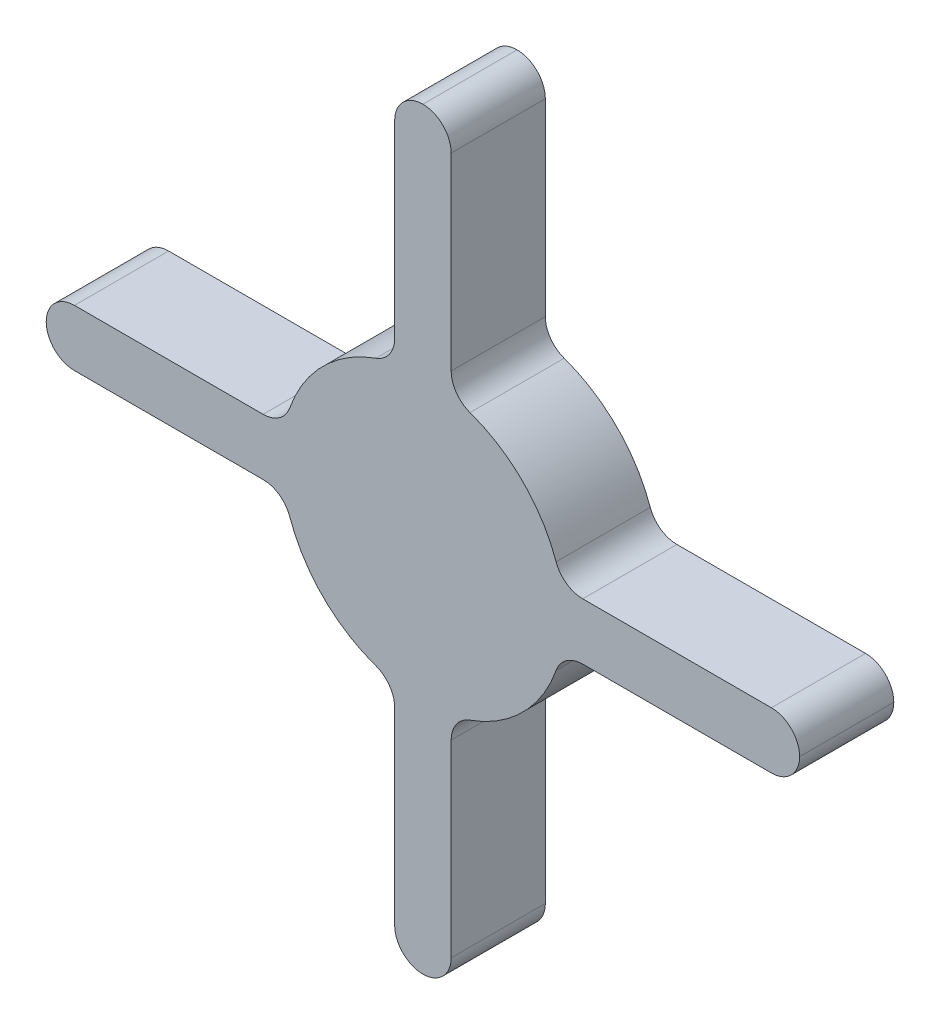
ISO-10303-21;
HEADER;
FILE_DESCRIPTION(('STEP AP214'),'2;1');
FILE_NAME('part.step','',(''),(''),'','','');
FILE_SCHEMA(('AUTOMOTIVE_DESIGN { 1 0 10303 214 1 1 1 1 }'));
ENDSEC;
DATA;
#1=APPLICATION_CONTEXT('core data for automotive mechanical design processes');
#2=APPLICATION_PROTOCOL_DEFINITION('international standard','automotive_design',2000,#1);
#3=PRODUCT_CONTEXT('',#1,'mechanical');
#4=PRODUCT('Part','Part','',(#3));
#5=PRODUCT_RELATED_PRODUCT_CATEGORY('part','',(#4));
#6=PRODUCT_DEFINITION_FORMATION('','',#4);
#7=PRODUCT_DEFINITION_CONTEXT('part definition',#1,'design');
#8=PRODUCT_DEFINITION('design','',#6,#7);
#9=PRODUCT_DEFINITION_SHAPE('','',#8);
#10=(LENGTH_UNIT() NAMED_UNIT(*) SI_UNIT(.MILLI.,.METRE.));
#11=(NAMED_UNIT(*) PLANE_ANGLE_UNIT() SI_UNIT($,.RADIAN.));
#12=(NAMED_UNIT(*) SI_UNIT($,.STERADIAN.) SOLID_ANGLE_UNIT());
#13=UNCERTAINTY_MEASURE_WITH_UNIT(LENGTH_MEASURE(1.E-05),#10,'distance_accuracy_value','');
#14=(GEOMETRIC_REPRESENTATION_CONTEXT(3) GLOBAL_UNCERTAINTY_ASSIGNED_CONTEXT((#13)) GLOBAL_UNIT_ASSIGNED_CONTEXT((#10,
#11,#12)) REPRESENTATION_CONTEXT('',''));
#15=CARTESIAN_POINT('',(0.,0.,0.));
#16=DIRECTION('',(0.,0.,1.));
#17=DIRECTION('',(1.,0.,0.));
#18=AXIS2_PLACEMENT_3D('',#15,#16,#17);
#19=CARTESIAN_POINT('',(-1.90499999999999,1.905,6.35));
#20=DIRECTION('',(1.,0.,0.));
#21=DIRECTION('',(0.,1.,0.));
#22=AXIS2_PLACEMENT_3D('',#19,#20,#21);
#23=PLANE('',#22);
#24=DIRECTION('',(0.,-1.,0.));
#25=VECTOR('',#24,1.);
#26=CARTESIAN_POINT('',(-1.90499999999999,1.905,0.));
#27=LINE('',#26,#25);
#28=CARTESIAN_POINT('',(-1.90499999999999,23.495,0.));
#29=VERTEX_POINT('',#28);
#30=CARTESIAN_POINT('',(-1.90499999999999,10.776307345283,0.));
#31=VERTEX_POINT('',#30);
#32=EDGE_CURVE('E412',#29,#31,#27,.T.);
#33=ORIENTED_EDGE('',*,*,#32,.T.);
#34=DIRECTION('',(0.,0.,1.));
#35=VECTOR('',#34,1.);
#36=CARTESIAN_POINT('',(-1.90499999999999,10.776307345283,6.35));
#37=LINE('',#36,#35);
#38=CARTESIAN_POINT('',(-1.90499999999999,10.776307345283,6.35));
#39=VERTEX_POINT('',#38);
#40=EDGE_CURVE('E272',#31,#39,#37,.T.);
#41=ORIENTED_EDGE('',*,*,#40,.T.);
#42=DIRECTION('',(0.,-1.,0.));
#43=VECTOR('',#42,1.);
#44=CARTESIAN_POINT('',(-1.90499999999999,1.905,6.35));
#45=LINE('',#44,#43);
#46=CARTESIAN_POINT('',(-1.90499999999999,23.495,6.35));
#47=VERTEX_POINT('',#46);
#48=EDGE_CURVE('E389',#47,#39,#45,.T.);
#49=ORIENTED_EDGE('',*,*,#48,.F.);
#50=DIRECTION('',(0.,0.,-1.));
#51=VECTOR('',#50,1.);
#52=CARTESIAN_POINT('',(-1.90499999999999,23.495,6.35));
#53=LINE('',#52,#51);
#54=EDGE_CURVE('E269',#47,#29,#53,.T.);
#55=ORIENTED_EDGE('',*,*,#54,.T.);
#56=EDGE_LOOP('',(#33,#41,#49,#55));
#57=FACE_BOUND('',#56,.T.);
#58=ADVANCED_FACE('F33',(#57),#23,.F.);
#59=CARTESIAN_POINT('',(-25.4,1.905,6.35));
#60=DIRECTION('',(0.,-1.,0.));
#61=DIRECTION('',(1.,0.,0.));
#62=AXIS2_PLACEMENT_3D('',#59,#60,#61);
#63=PLANE('',#62);
#64=DIRECTION('',(-1.,0.,0.));
#65=VECTOR('',#64,1.);
#66=CARTESIAN_POINT('',(-25.4,1.905,6.35));
#67=LINE('',#66,#65);
#68=CARTESIAN_POINT('',(-10.776307345283,1.905,6.35));
#69=VERTEX_POINT('',#68);
#70=CARTESIAN_POINT('',(-23.495,1.905,6.35));
#71=VERTEX_POINT('',#70);
#72=EDGE_CURVE('E392',#69,#71,#67,.T.);
#73=ORIENTED_EDGE('',*,*,#72,.F.);
#74=DIRECTION('',(0.,0.,1.));
#75=VECTOR('',#74,1.);
#76=CARTESIAN_POINT('',(-10.776307345283,1.905,0.));
#77=LINE('',#76,#75);
#78=CARTESIAN_POINT('',(-10.776307345283,1.905,0.));
#79=VERTEX_POINT('',#78);
#80=EDGE_CURVE('E267',#69,#79,#77,.F.);
#81=ORIENTED_EDGE('',*,*,#80,.T.);
#82=DIRECTION('',(-1.,0.,0.));
#83=VECTOR('',#82,1.);
#84=CARTESIAN_POINT('',(-25.4,1.905,0.));
#85=LINE('',#84,#83);
#86=CARTESIAN_POINT('',(-23.495,1.905,0.));
#87=VERTEX_POINT('',#86);
#88=EDGE_CURVE('E409',#79,#87,#85,.T.);
#89=ORIENTED_EDGE('',*,*,#88,.T.);
#90=DIRECTION('',(0.,0.,-1.));
#91=VECTOR('',#90,1.);
#92=CARTESIAN_POINT('',(-23.495,1.905,6.35));
#93=LINE('',#92,#91);
#94=EDGE_CURVE('E265',#87,#71,#93,.F.);
#95=ORIENTED_EDGE('',*,*,#94,.T.);
#96=EDGE_LOOP('',(#73,#81,#89,#95));
#97=FACE_BOUND('',#96,.T.);
#98=ADVANCED_FACE('F456',(#97),#63,.F.);
#99=CARTESIAN_POINT('',(-1.90499999999999,-1.905,6.35));
#100=DIRECTION('',(0.,1.,0.));
#101=DIRECTION('',(-1.,0.,0.));
#102=AXIS2_PLACEMENT_3D('',#99,#100,#101);
#103=PLANE('',#102);
#104=DIRECTION('',(1.,0.,0.));
#105=VECTOR('',#104,1.);
#106=CARTESIAN_POINT('',(-1.90499999999999,-1.905,0.));
#107=LINE('',#106,#105);
#108=CARTESIAN_POINT('',(-23.495,-1.905,0.));
#109=VERTEX_POINT('',#108);
#110=CARTESIAN_POINT('',(-10.776307345283,-1.905,0.));
#111=VERTEX_POINT('',#110);
#112=EDGE_CURVE('E406',#109,#111,#107,.T.);
#113=ORIENTED_EDGE('',*,*,#112,.T.);
#114=DIRECTION('',(0.,0.,1.));
#115=VECTOR('',#114,1.);
#116=CARTESIAN_POINT('',(-10.776307345283,-1.905,6.35));
#117=LINE('',#116,#115);
#118=CARTESIAN_POINT('',(-10.776307345283,-1.905,6.35));
#119=VERTEX_POINT('',#118);
#120=EDGE_CURVE('E248',#111,#119,#117,.T.);
#121=ORIENTED_EDGE('',*,*,#120,.T.);
#122=DIRECTION('',(1.,0.,0.));
#123=VECTOR('',#122,1.);
#124=CARTESIAN_POINT('',(-1.90499999999999,-1.905,6.35));
#125=LINE('',#124,#123);
#126=CARTESIAN_POINT('',(-23.495,-1.905,6.35));
#127=VERTEX_POINT('',#126);
#128=EDGE_CURVE('E225',#127,#119,#125,.T.);
#129=ORIENTED_EDGE('',*,*,#128,.F.);
#130=DIRECTION('',(0.,0.,-1.));
#131=VECTOR('',#130,1.);
#132=CARTESIAN_POINT('',(-23.495,-1.905,6.35));
#133=LINE('',#132,#131);
#134=EDGE_CURVE('E245',#127,#109,#133,.T.);
#135=ORIENTED_EDGE('',*,*,#134,.T.);
#136=EDGE_LOOP('',(#113,#121,#129,#135));
#137=FACE_BOUND('',#136,.T.);
#138=ADVANCED_FACE('F461',(#137),#103,.F.);
#139=CARTESIAN_POINT('',(-1.90499999999999,-25.4,6.35));
#140=DIRECTION('',(1.,0.,0.));
#141=DIRECTION('',(0.,1.,0.));
#142=AXIS2_PLACEMENT_3D('',#139,#140,#141);
#143=PLANE('',#142);
#144=DIRECTION('',(0.,-1.,0.));
#145=VECTOR('',#144,1.);
#146=CARTESIAN_POINT('',(-1.90499999999999,-25.4,6.35));
#147=LINE('',#146,#145);
#148=CARTESIAN_POINT('',(-1.90499999999999,-10.776307345283,6.35));
#149=VERTEX_POINT('',#148);
#150=CARTESIAN_POINT('',(-1.90499999999999,-23.495,6.35));
#151=VERTEX_POINT('',#150);
#152=EDGE_CURVE('E426',#149,#151,#147,.T.);
#153=ORIENTED_EDGE('',*,*,#152,.F.);
#154=DIRECTION('',(0.,0.,1.));
#155=VECTOR('',#154,1.);
#156=CARTESIAN_POINT('',(-1.90499999999999,-10.776307345283,0.));
#157=LINE('',#156,#155);
#158=CARTESIAN_POINT('',(-1.90499999999999,-10.776307345283,0.));
#159=VERTEX_POINT('',#158);
#160=EDGE_CURVE('E257',#149,#159,#157,.F.);
#161=ORIENTED_EDGE('',*,*,#160,.T.);
#162=DIRECTION('',(0.,-1.,0.));
#163=VECTOR('',#162,1.);
#164=CARTESIAN_POINT('',(-1.90499999999999,-25.4,0.));
#165=LINE('',#164,#163);
#166=CARTESIAN_POINT('',(-1.90499999999999,-23.495,0.));
#167=VERTEX_POINT('',#166);
#168=EDGE_CURVE('E403',#159,#167,#165,.T.);
#169=ORIENTED_EDGE('',*,*,#168,.T.);
#170=DIRECTION('',(0.,0.,-1.));
#171=VECTOR('',#170,1.);
#172=CARTESIAN_POINT('',(-1.90499999999999,-23.495,6.35));
#173=LINE('',#172,#171);
#174=EDGE_CURVE('E255',#167,#151,#173,.F.);
#175=ORIENTED_EDGE('',*,*,#174,.T.);
#176=EDGE_LOOP('',(#153,#161,#169,#175));
#177=FACE_BOUND('',#176,.T.);
#178=ADVANCED_FACE('F644',(#177),#143,.F.);
#179=CARTESIAN_POINT('',(1.905,-1.905,6.35));
#180=DIRECTION('',(-1.,0.,0.));
#181=DIRECTION('',(0.,-1.,0.));
#182=AXIS2_PLACEMENT_3D('',#179,#180,#181);
#183=PLANE('',#182);
#184=DIRECTION('',(0.,1.,0.));
#185=VECTOR('',#184,1.);
#186=CARTESIAN_POINT('',(1.905,-1.905,0.));
#187=LINE('',#186,#185);
#188=CARTESIAN_POINT('',(1.90500000000001,-23.495,0.));
#189=VERTEX_POINT('',#188);
#190=CARTESIAN_POINT('',(1.905,-10.776307345283,0.));
#191=VERTEX_POINT('',#190);
#192=EDGE_CURVE('E400',#189,#191,#187,.T.);
#193=ORIENTED_EDGE('',*,*,#192,.T.);
#194=DIRECTION('',(0.,0.,1.));
#195=VECTOR('',#194,1.);
#196=CARTESIAN_POINT('',(1.905,-10.776307345283,6.35));
#197=LINE('',#196,#195);
#198=CARTESIAN_POINT('',(1.905,-10.776307345283,6.35));
#199=VERTEX_POINT('',#198);
#200=EDGE_CURVE('E302',#191,#199,#197,.T.);
#201=ORIENTED_EDGE('',*,*,#200,.T.);
#202=DIRECTION('',(0.,1.,0.));
#203=VECTOR('',#202,1.);
#204=CARTESIAN_POINT('',(1.905,-1.905,6.35));
#205=LINE('',#204,#203);
#206=CARTESIAN_POINT('',(1.90500000000001,-23.495,6.35));
#207=VERTEX_POINT('',#206);
#208=EDGE_CURVE('E423',#207,#199,#205,.T.);
#209=ORIENTED_EDGE('',*,*,#208,.F.);
#210=DIRECTION('',(0.,0.,-1.));
#211=VECTOR('',#210,1.);
#212=CARTESIAN_POINT('',(1.90500000000001,-23.495,6.35));
#213=LINE('',#212,#211);
#214=EDGE_CURVE('E299',#207,#189,#213,.T.);
#215=ORIENTED_EDGE('',*,*,#214,.T.);
#216=EDGE_LOOP('',(#193,#201,#209,#215));
#217=FACE_BOUND('',#216,.T.);
#218=ADVANCED_FACE('F636',(#217),#183,.F.);
#219=CARTESIAN_POINT('',(25.4,-1.905,6.35));
#220=DIRECTION('',(0.,1.,0.));
#221=DIRECTION('',(-1.,0.,0.));
#222=AXIS2_PLACEMENT_3D('',#219,#220,#221);
#223=PLANE('',#222);
#224=DIRECTION('',(1.,0.,0.));
#225=VECTOR('',#224,1.);
#226=CARTESIAN_POINT('',(25.4,-1.905,6.35));
#227=LINE('',#226,#225);
#228=CARTESIAN_POINT('',(10.776307345283,-1.905,6.35));
#229=VERTEX_POINT('',#228);
#230=CARTESIAN_POINT('',(23.495,-1.905,6.35));
#231=VERTEX_POINT('',#230);
#232=EDGE_CURVE('E420',#229,#231,#227,.T.);
#233=ORIENTED_EDGE('',*,*,#232,.F.);
#234=DIRECTION('',(0.,0.,1.));
#235=VECTOR('',#234,1.);
#236=CARTESIAN_POINT('',(10.776307345283,-1.905,0.));
#237=LINE('',#236,#235);
#238=CARTESIAN_POINT('',(10.776307345283,-1.905,0.));
#239=VERTEX_POINT('',#238);
#240=EDGE_CURVE('E297',#229,#239,#237,.F.);
#241=ORIENTED_EDGE('',*,*,#240,.T.);
#242=DIRECTION('',(1.,0.,0.));
#243=VECTOR('',#242,1.);
#244=CARTESIAN_POINT('',(25.4,-1.905,0.));
#245=LINE('',#244,#243);
#246=CARTESIAN_POINT('',(23.495,-1.905,0.));
#247=VERTEX_POINT('',#246);
#248=EDGE_CURVE('E395',#239,#247,#245,.T.);
#249=ORIENTED_EDGE('',*,*,#248,.T.);
#250=DIRECTION('',(0.,0.,-1.));
#251=VECTOR('',#250,1.);
#252=CARTESIAN_POINT('',(23.495,-1.905,6.35));
#253=LINE('',#252,#251);
#254=EDGE_CURVE('E295',#247,#231,#253,.F.);
#255=ORIENTED_EDGE('',*,*,#254,.T.);
#256=EDGE_LOOP('',(#233,#241,#249,#255));
#257=FACE_BOUND('',#256,.T.);
#258=ADVANCED_FACE('F628',(#257),#223,.F.);
#259=CARTESIAN_POINT('',(1.90500000000001,1.905,6.35));
#260=DIRECTION('',(0.,-1.,0.));
#261=DIRECTION('',(1.,0.,0.));
#262=AXIS2_PLACEMENT_3D('',#259,#260,#261);
#263=PLANE('',#262);
#264=DIRECTION('',(-1.,0.,0.));
#265=VECTOR('',#264,1.);
#266=CARTESIAN_POINT('',(1.90500000000001,1.905,0.));
#267=LINE('',#266,#265);
#268=CARTESIAN_POINT('',(23.495,1.905,0.));
#269=VERTEX_POINT('',#268);
#270=CARTESIAN_POINT('',(10.776307345283,1.905,0.));
#271=VERTEX_POINT('',#270);
#272=EDGE_CURVE('E390',#269,#271,#267,.T.);
#273=ORIENTED_EDGE('',*,*,#272,.T.);
#274=DIRECTION('',(0.,0.,1.));
#275=VECTOR('',#274,1.);
#276=CARTESIAN_POINT('',(10.776307345283,1.905,6.35));
#277=LINE('',#276,#275);
#278=CARTESIAN_POINT('',(10.776307345283,1.905,6.35));
#279=VERTEX_POINT('',#278);
#280=EDGE_CURVE('E287',#271,#279,#277,.T.);
#281=ORIENTED_EDGE('',*,*,#280,.T.);
#282=DIRECTION('',(-1.,0.,0.));
#283=VECTOR('',#282,1.);
#284=CARTESIAN_POINT('',(1.90500000000001,1.905,6.35));
#285=LINE('',#284,#283);
#286=CARTESIAN_POINT('',(23.495,1.905,6.35));
#287=VERTEX_POINT('',#286);
#288=EDGE_CURVE('E417',#287,#279,#285,.T.);
#289=ORIENTED_EDGE('',*,*,#288,.F.);
#290=DIRECTION('',(0.,0.,-1.));
#291=VECTOR('',#290,1.);
#292=CARTESIAN_POINT('',(23.495,1.905,6.35));
#293=LINE('',#292,#291);
#294=EDGE_CURVE('E284',#287,#269,#293,.T.);
#295=ORIENTED_EDGE('',*,*,#294,.T.);
#296=EDGE_LOOP('',(#273,#281,#289,#295));
#297=FACE_BOUND('',#296,.T.);
#298=ADVANCED_FACE('F621',(#297),#263,.F.);
#299=CARTESIAN_POINT('',(1.90500000000001,25.4,6.35));
#300=DIRECTION('',(-1.,0.,0.));
#301=DIRECTION('',(0.,-1.,0.));
#302=AXIS2_PLACEMENT_3D('',#299,#300,#301);
#303=PLANE('',#302);
#304=DIRECTION('',(0.,1.,0.));
#305=VECTOR('',#304,1.);
#306=CARTESIAN_POINT('',(1.90500000000001,25.4,6.35));
#307=LINE('',#306,#305);
#308=CARTESIAN_POINT('',(1.90500000000001,10.776307345283,6.35));
#309=VERTEX_POINT('',#308);
#310=CARTESIAN_POINT('',(1.90500000000001,23.495,6.35));
#311=VERTEX_POINT('',#310);
#312=EDGE_CURVE('E250',#309,#311,#307,.T.);
#313=ORIENTED_EDGE('',*,*,#312,.F.);
#314=DIRECTION('',(0.,0.,1.));
#315=VECTOR('',#314,1.);
#316=CARTESIAN_POINT('',(1.90500000000001,10.776307345283,0.));
#317=LINE('',#316,#315);
#318=CARTESIAN_POINT('',(1.90500000000001,10.776307345283,0.));
#319=VERTEX_POINT('',#318);
#320=EDGE_CURVE('E282',#309,#319,#317,.F.);
#321=ORIENTED_EDGE('',*,*,#320,.T.);
#322=DIRECTION('',(0.,1.,0.));
#323=VECTOR('',#322,1.);
#324=CARTESIAN_POINT('',(1.90500000000001,25.4,0.));
#325=LINE('',#324,#323);
#326=CARTESIAN_POINT('',(1.90500000000001,23.495,0.));
#327=VERTEX_POINT('',#326);
#328=EDGE_CURVE('E382',#319,#327,#325,.T.);
#329=ORIENTED_EDGE('',*,*,#328,.T.);
#330=DIRECTION('',(0.,0.,-1.));
#331=VECTOR('',#330,1.);
#332=CARTESIAN_POINT('',(1.90500000000001,23.495,6.35));
#333=LINE('',#332,#331);
#334=EDGE_CURVE('E280',#327,#311,#333,.F.);
#335=ORIENTED_EDGE('',*,*,#334,.T.);
#336=EDGE_LOOP('',(#313,#321,#329,#335));
#337=FACE_BOUND('',#336,.T.);
#338=ADVANCED_FACE('F387',(#337),#303,.F.);
#339=CARTESIAN_POINT('',(1.90500000000001,25.4,6.35));
#340=DIRECTION('',(0.,0.,-1.));
#341=DIRECTION('',(-1.,0.,0.));
#342=AXIS2_PLACEMENT_3D('',#339,#340,#341);
#343=PLANE('',#342);
#344=CARTESIAN_POINT('',(23.495,0.,6.35));
#345=DIRECTION('',(0.,0.,-1.));
#346=DIRECTION('',(-1.,0.,0.));
#347=AXIS2_PLACEMENT_3D('',#344,#345,#346);
#348=CIRCLE('',#347,1.905);
#349=CARTESIAN_POINT('',(25.4,0.,6.35));
#350=VERTEX_POINT('',#349);
#351=EDGE_CURVE('E330',#231,#350,#348,.F.);
#352=ORIENTED_EDGE('',*,*,#351,.T.);
#353=CARTESIAN_POINT('',(23.495,0.,6.35));
#354=DIRECTION('',(0.,0.,-1.));
#355=DIRECTION('',(-1.,0.,0.));
#356=AXIS2_PLACEMENT_3D('',#353,#354,#355);
#357=CIRCLE('',#356,1.905);
#358=EDGE_CURVE('E332',#350,#287,#357,.F.);
#359=ORIENTED_EDGE('',*,*,#358,.T.);
#360=ORIENTED_EDGE('',*,*,#288,.T.);
#361=CARTESIAN_POINT('',(10.776307345283,3.81,6.35));
#362=DIRECTION('',(0.,0.,-1.));
#363=DIRECTION('',(-1.,0.,0.));
#364=AXIS2_PLACEMENT_3D('',#361,#362,#363);
#365=CIRCLE('',#364,1.905);
#366=CARTESIAN_POINT('',(8.98025612106916,3.175,6.35));
#367=VERTEX_POINT('',#366);
#368=EDGE_CURVE('E352',#279,#367,#365,.T.);
#369=ORIENTED_EDGE('',*,*,#368,.T.);
#370=CARTESIAN_POINT('',(0.,0.,6.35));
#371=DIRECTION('',(0.,0.,1.));
#372=DIRECTION('',(1.,0.,0.));
#373=AXIS2_PLACEMENT_3D('',#370,#371,#372);
#374=CIRCLE('',#373,9.525);
#375=CARTESIAN_POINT('',(3.17500000000001,8.98025612106915,6.35));
#376=VERTEX_POINT('',#375);
#377=EDGE_CURVE('E415',#367,#376,#374,.T.);
#378=ORIENTED_EDGE('',*,*,#377,.T.);
#379=CARTESIAN_POINT('',(3.81000000000001,10.776307345283,6.35));
#380=DIRECTION('',(0.,0.,-1.));
#381=DIRECTION('',(-1.,0.,0.));
#382=AXIS2_PLACEMENT_3D('',#379,#380,#381);
#383=CIRCLE('',#382,1.905);
#384=EDGE_CURVE('E346',#376,#309,#383,.T.);
#385=ORIENTED_EDGE('',*,*,#384,.T.);
#386=ORIENTED_EDGE('',*,*,#312,.T.);
#387=CARTESIAN_POINT('',(0.,23.495,6.35));
#388=DIRECTION('',(0.,0.,-1.));
#389=DIRECTION('',(-1.,0.,0.));
#390=AXIS2_PLACEMENT_3D('',#387,#388,#389);
#391=CIRCLE('',#390,1.905);
#392=CARTESIAN_POINT('',(0.,25.4,6.35));
#393=VERTEX_POINT('',#392);
#394=EDGE_CURVE('E57',#311,#393,#391,.F.);
#395=ORIENTED_EDGE('',*,*,#394,.T.);
#396=CARTESIAN_POINT('',(0.,23.495,6.35));
#397=DIRECTION('',(0.,0.,-1.));
#398=DIRECTION('',(-1.,0.,0.));
#399=AXIS2_PLACEMENT_3D('',#396,#397,#398);
#400=CIRCLE('',#399,1.905);
#401=EDGE_CURVE('E321',#393,#47,#400,.F.);
#402=ORIENTED_EDGE('',*,*,#401,.T.);
#403=ORIENTED_EDGE('',*,*,#48,.T.);
#404=CARTESIAN_POINT('',(-3.80999999999999,10.776307345283,6.35));
#405=DIRECTION('',(0.,0.,-1.));
#406=DIRECTION('',(-1.,0.,0.));
#407=AXIS2_PLACEMENT_3D('',#404,#405,#406);
#408=CIRCLE('',#407,1.905);
#409=CARTESIAN_POINT('',(-3.17499999999999,8.98025612106916,6.35));
#410=VERTEX_POINT('',#409);
#411=EDGE_CURVE('E344',#39,#410,#408,.T.);
#412=ORIENTED_EDGE('',*,*,#411,.T.);
#413=CARTESIAN_POINT('',(-8.98025612106916,3.175,6.35));
#414=VERTEX_POINT('',#413);
#415=EDGE_CURVE('E241',#410,#414,#374,.T.);
#416=ORIENTED_EDGE('',*,*,#415,.T.);
#417=CARTESIAN_POINT('',(-10.776307345283,3.81,6.35));
#418=DIRECTION('',(0.,0.,-1.));
#419=DIRECTION('',(-1.,0.,0.));
#420=AXIS2_PLACEMENT_3D('',#417,#418,#419);
#421=CIRCLE('',#420,1.905);
#422=EDGE_CURVE('E338',#414,#69,#421,.T.);
#423=ORIENTED_EDGE('',*,*,#422,.T.);
#424=ORIENTED_EDGE('',*,*,#72,.T.);
#425=CARTESIAN_POINT('',(-23.495,0.,6.35));
#426=DIRECTION('',(0.,0.,-1.));
#427=DIRECTION('',(-1.,0.,0.));
#428=AXIS2_PLACEMENT_3D('',#425,#426,#427);
#429=CIRCLE('',#428,1.905);
#430=CARTESIAN_POINT('',(-25.4,0.,6.35));
#431=VERTEX_POINT('',#430);
#432=EDGE_CURVE('E50',#71,#431,#429,.F.);
#433=ORIENTED_EDGE('',*,*,#432,.T.);
#434=CARTESIAN_POINT('',(-23.495,0.,6.35));
#435=DIRECTION('',(0.,0.,-1.));
#436=DIRECTION('',(-1.,0.,0.));
#437=AXIS2_PLACEMENT_3D('',#434,#435,#436);
#438=CIRCLE('',#437,1.905);
#439=EDGE_CURVE('E324',#431,#127,#438,.F.);
#440=ORIENTED_EDGE('',*,*,#439,.T.);
#441=ORIENTED_EDGE('',*,*,#128,.T.);
#442=CARTESIAN_POINT('',(-10.776307345283,-3.81,6.35));
#443=DIRECTION('',(0.,0.,-1.));
#444=DIRECTION('',(-1.,0.,0.));
#445=AXIS2_PLACEMENT_3D('',#442,#443,#444);
#446=CIRCLE('',#445,1.905);
#447=CARTESIAN_POINT('',(-8.98025612106916,-3.175,6.35));
#448=VERTEX_POINT('',#447);
#449=EDGE_CURVE('E220',#119,#448,#446,.T.);
#450=ORIENTED_EDGE('',*,*,#449,.T.);
#451=CARTESIAN_POINT('',(-3.17499999999999,-8.98025612106916,6.35));
#452=VERTEX_POINT('',#451);
#453=EDGE_CURVE('E223',#448,#452,#374,.T.);
#454=ORIENTED_EDGE('',*,*,#453,.T.);
#455=CARTESIAN_POINT('',(-3.80999999999999,-10.776307345283,6.35));
#456=DIRECTION('',(0.,0.,-1.));
#457=DIRECTION('',(-1.,0.,0.));
#458=AXIS2_PLACEMENT_3D('',#455,#456,#457);
#459=CIRCLE('',#458,1.905);
#460=EDGE_CURVE('E229',#452,#149,#459,.T.);
#461=ORIENTED_EDGE('',*,*,#460,.T.);
#462=ORIENTED_EDGE('',*,*,#152,.T.);
#463=CARTESIAN_POINT('',(0.,-23.495,6.35));
#464=DIRECTION('',(0.,0.,-1.));
#465=DIRECTION('',(-1.,0.,0.));
#466=AXIS2_PLACEMENT_3D('',#463,#464,#465);
#467=CIRCLE('',#466,1.905);
#468=CARTESIAN_POINT('',(0.,-25.4,6.35));
#469=VERTEX_POINT('',#468);
#470=EDGE_CURVE('E326',#151,#469,#467,.F.);
#471=ORIENTED_EDGE('',*,*,#470,.T.);
#472=CARTESIAN_POINT('',(0.,-23.495,6.35));
#473=DIRECTION('',(0.,0.,-1.));
#474=DIRECTION('',(-1.,0.,0.));
#475=AXIS2_PLACEMENT_3D('',#472,#473,#474);
#476=CIRCLE('',#475,1.905);
#477=EDGE_CURVE('E328',#469,#207,#476,.F.);
#478=ORIENTED_EDGE('',*,*,#477,.T.);
#479=ORIENTED_EDGE('',*,*,#208,.T.);
#480=CARTESIAN_POINT('',(3.81,-10.776307345283,6.35));
#481=DIRECTION('',(0.,0.,-1.));
#482=DIRECTION('',(-1.,0.,0.));
#483=AXIS2_PLACEMENT_3D('',#480,#481,#482);
#484=CIRCLE('',#483,1.905);
#485=CARTESIAN_POINT('',(3.175,-8.98025612106915,6.35));
#486=VERTEX_POINT('',#485);
#487=EDGE_CURVE('E11',#199,#486,#484,.T.);
#488=ORIENTED_EDGE('',*,*,#487,.T.);
#489=CARTESIAN_POINT('',(8.98025612106915,-3.175,6.35));
#490=VERTEX_POINT('',#489);
#491=EDGE_CURVE('E242',#486,#490,#374,.T.);
#492=ORIENTED_EDGE('',*,*,#491,.T.);
#493=CARTESIAN_POINT('',(10.776307345283,-3.81,6.35));
#494=DIRECTION('',(0.,0.,-1.));
#495=DIRECTION('',(-1.,0.,0.));
#496=AXIS2_PLACEMENT_3D('',#493,#494,#495);
#497=CIRCLE('',#496,1.905);
#498=EDGE_CURVE('E354',#490,#229,#497,.T.);
#499=ORIENTED_EDGE('',*,*,#498,.T.);
#500=ORIENTED_EDGE('',*,*,#232,.T.);
#501=EDGE_LOOP('',(#352,#359,#360,#369,#378,#385,#386,#395,#402,#403,#412,#416,#423,#424,#433,
#440,#441,#450,#454,#461,#462,#471,#478,#479,#488,#492,#499,#500));
#502=FACE_BOUND('',#501,.T.);
#503=ADVANCED_FACE('F222',(#502),#343,.F.);
#504=CARTESIAN_POINT('',(1.90500000000001,25.4,0.));
#505=DIRECTION('',(0.,0.,-1.));
#506=DIRECTION('',(-1.,0.,0.));
#507=AXIS2_PLACEMENT_3D('',#504,#505,#506);
#508=PLANE('',#507);
#509=ORIENTED_EDGE('',*,*,#272,.F.);
#510=CARTESIAN_POINT('',(23.495,0.,0.));
#511=DIRECTION('',(0.,0.,-1.));
#512=DIRECTION('',(-1.,0.,0.));
#513=AXIS2_PLACEMENT_3D('',#510,#511,#512);
#514=CIRCLE('',#513,1.905);
#515=CARTESIAN_POINT('',(25.4,0.,0.));
#516=VERTEX_POINT('',#515);
#517=EDGE_CURVE('E318',#269,#516,#514,.T.);
#518=ORIENTED_EDGE('',*,*,#517,.T.);
#519=CARTESIAN_POINT('',(23.495,0.,0.));
#520=DIRECTION('',(0.,0.,-1.));
#521=DIRECTION('',(-1.,0.,0.));
#522=AXIS2_PLACEMENT_3D('',#519,#520,#521);
#523=CIRCLE('',#522,1.905);
#524=EDGE_CURVE('E316',#516,#247,#523,.T.);
#525=ORIENTED_EDGE('',*,*,#524,.T.);
#526=ORIENTED_EDGE('',*,*,#248,.F.);
#527=CARTESIAN_POINT('',(10.776307345283,-3.81,0.));
#528=DIRECTION('',(0.,0.,-1.));
#529=DIRECTION('',(-1.,0.,0.));
#530=AXIS2_PLACEMENT_3D('',#527,#528,#529);
#531=CIRCLE('',#530,1.905);
#532=CARTESIAN_POINT('',(8.98025612106915,-3.175,0.));
#533=VERTEX_POINT('',#532);
#534=EDGE_CURVE('E356',#239,#533,#531,.F.);
#535=ORIENTED_EDGE('',*,*,#534,.T.);
#536=CARTESIAN_POINT('',(0.,0.,0.));
#537=DIRECTION('',(0.,0.,1.));
#538=DIRECTION('',(1.,0.,0.));
#539=AXIS2_PLACEMENT_3D('',#536,#537,#538);
#540=CIRCLE('',#539,9.525);
#541=CARTESIAN_POINT('',(3.175,-8.98025612106915,0.));
#542=VERTEX_POINT('',#541);
#543=EDGE_CURVE('E362',#542,#533,#540,.T.);
#544=ORIENTED_EDGE('',*,*,#543,.F.);
#545=CARTESIAN_POINT('',(3.81,-10.776307345283,0.));
#546=DIRECTION('',(0.,0.,-1.));
#547=DIRECTION('',(-1.,0.,0.));
#548=AXIS2_PLACEMENT_3D('',#545,#546,#547);
#549=CIRCLE('',#548,1.905);
#550=EDGE_CURVE('E42',#542,#191,#549,.F.);
#551=ORIENTED_EDGE('',*,*,#550,.T.);
#552=ORIENTED_EDGE('',*,*,#192,.F.);
#553=CARTESIAN_POINT('',(0.,-23.495,0.));
#554=DIRECTION('',(0.,0.,-1.));
#555=DIRECTION('',(-1.,0.,0.));
#556=AXIS2_PLACEMENT_3D('',#553,#554,#555);
#557=CIRCLE('',#556,1.905);
#558=CARTESIAN_POINT('',(0.,-25.4,0.));
#559=VERTEX_POINT('',#558);
#560=EDGE_CURVE('E314',#189,#559,#557,.T.);
#561=ORIENTED_EDGE('',*,*,#560,.T.);
#562=CARTESIAN_POINT('',(0.,-23.495,0.));
#563=DIRECTION('',(0.,0.,-1.));
#564=DIRECTION('',(-1.,0.,0.));
#565=AXIS2_PLACEMENT_3D('',#562,#563,#564);
#566=CIRCLE('',#565,1.905);
#567=EDGE_CURVE('E312',#559,#167,#566,.T.);
#568=ORIENTED_EDGE('',*,*,#567,.T.);
#569=ORIENTED_EDGE('',*,*,#168,.F.);
#570=CARTESIAN_POINT('',(-3.80999999999999,-10.776307345283,0.));
#571=DIRECTION('',(0.,0.,-1.));
#572=DIRECTION('',(-1.,0.,0.));
#573=AXIS2_PLACEMENT_3D('',#570,#571,#572);
#574=CIRCLE('',#573,1.905);
#575=CARTESIAN_POINT('',(-3.17499999999999,-8.98025612106916,0.));
#576=VERTEX_POINT('',#575);
#577=EDGE_CURVE('E336',#159,#576,#574,.F.);
#578=ORIENTED_EDGE('',*,*,#577,.T.);
#579=CARTESIAN_POINT('',(-8.98025612106916,-3.175,0.));
#580=VERTEX_POINT('',#579);
#581=EDGE_CURVE('E432',#580,#576,#540,.T.);
#582=ORIENTED_EDGE('',*,*,#581,.F.);
#583=CARTESIAN_POINT('',(-10.776307345283,-3.81,0.));
#584=DIRECTION('',(0.,0.,-1.));
#585=DIRECTION('',(-1.,0.,0.));
#586=AXIS2_PLACEMENT_3D('',#583,#584,#585);
#587=CIRCLE('',#586,1.905);
#588=EDGE_CURVE('E230',#580,#111,#587,.F.);
#589=ORIENTED_EDGE('',*,*,#588,.T.);
#590=ORIENTED_EDGE('',*,*,#112,.F.);
#591=CARTESIAN_POINT('',(-23.495,0.,0.));
#592=DIRECTION('',(0.,0.,-1.));
#593=DIRECTION('',(-1.,0.,0.));
#594=AXIS2_PLACEMENT_3D('',#591,#592,#593);
#595=CIRCLE('',#594,1.905);
#596=CARTESIAN_POINT('',(-25.4,0.,0.));
#597=VERTEX_POINT('',#596);
#598=EDGE_CURVE('E310',#109,#597,#595,.T.);
#599=ORIENTED_EDGE('',*,*,#598,.T.);
#600=CARTESIAN_POINT('',(-23.495,0.,0.));
#601=DIRECTION('',(0.,0.,-1.));
#602=DIRECTION('',(-1.,0.,0.));
#603=AXIS2_PLACEMENT_3D('',#600,#601,#602);
#604=CIRCLE('',#603,1.905);
#605=EDGE_CURVE('E308',#597,#87,#604,.T.);
#606=ORIENTED_EDGE('',*,*,#605,.T.);
#607=ORIENTED_EDGE('',*,*,#88,.F.);
#608=CARTESIAN_POINT('',(-10.776307345283,3.81,0.));
#609=DIRECTION('',(0.,0.,-1.));
#610=DIRECTION('',(-1.,0.,0.));
#611=AXIS2_PLACEMENT_3D('',#608,#609,#610);
#612=CIRCLE('',#611,1.905);
#613=CARTESIAN_POINT('',(-8.98025612106916,3.175,0.));
#614=VERTEX_POINT('',#613);
#615=EDGE_CURVE('E340',#79,#614,#612,.F.);
#616=ORIENTED_EDGE('',*,*,#615,.T.);
#617=CARTESIAN_POINT('',(-3.17499999999999,8.98025612106916,0.));
#618=VERTEX_POINT('',#617);
#619=EDGE_CURVE('E437',#618,#614,#540,.T.);
#620=ORIENTED_EDGE('',*,*,#619,.F.);
#621=CARTESIAN_POINT('',(-3.80999999999999,10.776307345283,0.));
#622=DIRECTION('',(0.,0.,-1.));
#623=DIRECTION('',(-1.,0.,0.));
#624=AXIS2_PLACEMENT_3D('',#621,#622,#623);
#625=CIRCLE('',#624,1.905);
#626=EDGE_CURVE('E342',#618,#31,#625,.F.);
#627=ORIENTED_EDGE('',*,*,#626,.T.);
#628=ORIENTED_EDGE('',*,*,#32,.F.);
#629=CARTESIAN_POINT('',(0.,23.495,0.));
#630=DIRECTION('',(0.,0.,-1.));
#631=DIRECTION('',(-1.,0.,0.));
#632=AXIS2_PLACEMENT_3D('',#629,#630,#631);
#633=CIRCLE('',#632,1.905);
#634=CARTESIAN_POINT('',(0.,25.4,0.));
#635=VERTEX_POINT('',#634);
#636=EDGE_CURVE('E306',#29,#635,#633,.T.);
#637=ORIENTED_EDGE('',*,*,#636,.T.);
#638=CARTESIAN_POINT('',(0.,23.495,0.));
#639=DIRECTION('',(0.,0.,-1.));
#640=DIRECTION('',(-1.,0.,0.));
#641=AXIS2_PLACEMENT_3D('',#638,#639,#640);
#642=CIRCLE('',#641,1.905);
#643=EDGE_CURVE('E304',#635,#327,#642,.T.);
#644=ORIENTED_EDGE('',*,*,#643,.T.);
#645=ORIENTED_EDGE('',*,*,#328,.F.);
#646=CARTESIAN_POINT('',(3.81000000000001,10.776307345283,0.));
#647=DIRECTION('',(0.,0.,-1.));
#648=DIRECTION('',(-1.,0.,0.));
#649=AXIS2_PLACEMENT_3D('',#646,#647,#648);
#650=CIRCLE('',#649,1.905);
#651=CARTESIAN_POINT('',(3.17500000000001,8.98025612106915,0.));
#652=VERTEX_POINT('',#651);
#653=EDGE_CURVE('E348',#319,#652,#650,.F.);
#654=ORIENTED_EDGE('',*,*,#653,.T.);
#655=CARTESIAN_POINT('',(8.98025612106916,3.175,0.));
#656=VERTEX_POINT('',#655);
#657=EDGE_CURVE('E433',#656,#652,#540,.T.);
#658=ORIENTED_EDGE('',*,*,#657,.F.);
#659=CARTESIAN_POINT('',(10.776307345283,3.81,0.));
#660=DIRECTION('',(0.,0.,-1.));
#661=DIRECTION('',(-1.,0.,0.));
#662=AXIS2_PLACEMENT_3D('',#659,#660,#661);
#663=CIRCLE('',#662,1.905);
#664=EDGE_CURVE('E350',#656,#271,#663,.F.);
#665=ORIENTED_EDGE('',*,*,#664,.T.);
#666=EDGE_LOOP('',(#509,#518,#525,#526,#535,#544,#551,#552,#561,#568,#569,#578,#582,#589,#590,
#599,#606,#607,#616,#620,#627,#628,#637,#644,#645,#654,#658,#665));
#667=FACE_BOUND('',#666,.T.);
#668=ADVANCED_FACE('F381',(#667),#508,.T.);
#669=CARTESIAN_POINT('',(0.,0.,6.35));
#670=DIRECTION('',(0.,0.,-1.));
#671=DIRECTION('',(-1.,0.,0.));
#672=AXIS2_PLACEMENT_3D('',#669,#670,#671);
#673=CYLINDRICAL_SURFACE('',#672,9.525);
#674=ORIENTED_EDGE('',*,*,#657,.T.);
#675=DIRECTION('',(0.,0.,-1.));
#676=VECTOR('',#675,1.);
#677=CARTESIAN_POINT('',(3.17500000000001,8.98025612106915,6.35));
#678=LINE('',#677,#676);
#679=EDGE_CURVE('E277',#652,#376,#678,.F.);
#680=ORIENTED_EDGE('',*,*,#679,.T.);
#681=ORIENTED_EDGE('',*,*,#377,.F.);
#682=DIRECTION('',(0.,0.,-1.));
#683=VECTOR('',#682,1.);
#684=CARTESIAN_POINT('',(8.98025612106915,3.175,6.35));
#685=LINE('',#684,#683);
#686=EDGE_CURVE('E274',#367,#656,#685,.T.);
#687=ORIENTED_EDGE('',*,*,#686,.T.);
#688=EDGE_LOOP('',(#674,#680,#681,#687));
#689=FACE_BOUND('',#688,.T.);
#690=ADVANCED_FACE('F585',(#689),#673,.T.);
#691=ORIENTED_EDGE('',*,*,#543,.T.);
#692=DIRECTION('',(0.,0.,-1.));
#693=VECTOR('',#692,1.);
#694=CARTESIAN_POINT('',(8.98025612106916,-3.175,6.35));
#695=LINE('',#694,#693);
#696=EDGE_CURVE('E292',#533,#490,#695,.F.);
#697=ORIENTED_EDGE('',*,*,#696,.T.);
#698=ORIENTED_EDGE('',*,*,#491,.F.);
#699=DIRECTION('',(0.,0.,-1.));
#700=VECTOR('',#699,1.);
#701=CARTESIAN_POINT('',(3.175,-8.98025612106915,6.35));
#702=LINE('',#701,#700);
#703=EDGE_CURVE('E289',#486,#542,#702,.T.);
#704=ORIENTED_EDGE('',*,*,#703,.T.);
#705=EDGE_LOOP('',(#691,#697,#698,#704));
#706=FACE_BOUND('',#705,.T.);
#707=ADVANCED_FACE('F591',(#706),#673,.T.);
#708=ORIENTED_EDGE('',*,*,#453,.F.);
#709=DIRECTION('',(0.,0.,-1.));
#710=VECTOR('',#709,1.);
#711=CARTESIAN_POINT('',(-8.98025612106916,-3.175,6.35));
#712=LINE('',#711,#710);
#713=EDGE_CURVE('E237',#448,#580,#712,.T.);
#714=ORIENTED_EDGE('',*,*,#713,.T.);
#715=ORIENTED_EDGE('',*,*,#581,.T.);
#716=DIRECTION('',(0.,0.,-1.));
#717=VECTOR('',#716,1.);
#718=CARTESIAN_POINT('',(-3.17499999999999,-8.98025612106916,6.35));
#719=LINE('',#718,#717);
#720=EDGE_CURVE('E240',#576,#452,#719,.F.);
#721=ORIENTED_EDGE('',*,*,#720,.T.);
#722=EDGE_LOOP('',(#708,#714,#715,#721));
#723=FACE_BOUND('',#722,.T.);
#724=ADVANCED_FACE('F235',(#723),#673,.T.);
#725=ORIENTED_EDGE('',*,*,#619,.T.);
#726=DIRECTION('',(0.,0.,-1.));
#727=VECTOR('',#726,1.);
#728=CARTESIAN_POINT('',(-8.98025612106915,3.175,6.35));
#729=LINE('',#728,#727);
#730=EDGE_CURVE('E262',#614,#414,#729,.F.);
#731=ORIENTED_EDGE('',*,*,#730,.T.);
#732=ORIENTED_EDGE('',*,*,#415,.F.);
#733=DIRECTION('',(0.,0.,-1.));
#734=VECTOR('',#733,1.);
#735=CARTESIAN_POINT('',(-3.17499999999999,8.98025612106916,6.35));
#736=LINE('',#735,#734);
#737=EDGE_CURVE('E259',#410,#618,#736,.T.);
#738=ORIENTED_EDGE('',*,*,#737,.T.);
#739=EDGE_LOOP('',(#725,#731,#732,#738));
#740=FACE_BOUND('',#739,.T.);
#741=ADVANCED_FACE('F447',(#740),#673,.T.);
#742=CARTESIAN_POINT('',(-10.776307345283,-3.81,6.35));
#743=DIRECTION('',(0.,0.,-1.));
#744=DIRECTION('',(-1.,0.,0.));
#745=AXIS2_PLACEMENT_3D('',#742,#743,#744);
#746=CYLINDRICAL_SURFACE('',#745,1.905);
#747=ORIENTED_EDGE('',*,*,#449,.F.);
#748=ORIENTED_EDGE('',*,*,#120,.F.);
#749=ORIENTED_EDGE('',*,*,#588,.F.);
#750=ORIENTED_EDGE('',*,*,#713,.F.);
#751=EDGE_LOOP('',(#747,#748,#749,#750));
#752=FACE_BOUND('',#751,.T.);
#753=ADVANCED_FACE('F244',(#752),#746,.F.);
#754=CARTESIAN_POINT('',(-3.80999999999999,-10.776307345283,6.35));
#755=DIRECTION('',(0.,0.,-1.));
#756=DIRECTION('',(-1.,0.,0.));
#757=AXIS2_PLACEMENT_3D('',#754,#755,#756);
#758=CYLINDRICAL_SURFACE('',#757,1.905);
#759=ORIENTED_EDGE('',*,*,#577,.F.);
#760=ORIENTED_EDGE('',*,*,#160,.F.);
#761=ORIENTED_EDGE('',*,*,#460,.F.);
#762=ORIENTED_EDGE('',*,*,#720,.F.);
#763=EDGE_LOOP('',(#759,#760,#761,#762));
#764=FACE_BOUND('',#763,.T.);
#765=ADVANCED_FACE('F468',(#764),#758,.F.);
#766=CARTESIAN_POINT('',(-10.776307345283,3.81,6.35));
#767=DIRECTION('',(0.,0.,-1.));
#768=DIRECTION('',(-1.,0.,0.));
#769=AXIS2_PLACEMENT_3D('',#766,#767,#768);
#770=CYLINDRICAL_SURFACE('',#769,1.905);
#771=ORIENTED_EDGE('',*,*,#615,.F.);
#772=ORIENTED_EDGE('',*,*,#80,.F.);
#773=ORIENTED_EDGE('',*,*,#422,.F.);
#774=ORIENTED_EDGE('',*,*,#730,.F.);
#775=EDGE_LOOP('',(#771,#772,#773,#774));
#776=FACE_BOUND('',#775,.T.);
#777=ADVANCED_FACE('F471',(#776),#770,.F.);
#778=CARTESIAN_POINT('',(-3.80999999999999,10.776307345283,6.35));
#779=DIRECTION('',(0.,0.,-1.));
#780=DIRECTION('',(-1.,0.,0.));
#781=AXIS2_PLACEMENT_3D('',#778,#779,#780);
#782=CYLINDRICAL_SURFACE('',#781,1.905);
#783=ORIENTED_EDGE('',*,*,#411,.F.);
#784=ORIENTED_EDGE('',*,*,#40,.F.);
#785=ORIENTED_EDGE('',*,*,#626,.F.);
#786=ORIENTED_EDGE('',*,*,#737,.F.);
#787=EDGE_LOOP('',(#783,#784,#785,#786));
#788=FACE_BOUND('',#787,.T.);
#789=ADVANCED_FACE('F451',(#788),#782,.F.);
#790=CARTESIAN_POINT('',(3.81000000000001,10.776307345283,6.35));
#791=DIRECTION('',(0.,0.,-1.));
#792=DIRECTION('',(-1.,0.,0.));
#793=AXIS2_PLACEMENT_3D('',#790,#791,#792);
#794=CYLINDRICAL_SURFACE('',#793,1.905);
#795=ORIENTED_EDGE('',*,*,#653,.F.);
#796=ORIENTED_EDGE('',*,*,#320,.F.);
#797=ORIENTED_EDGE('',*,*,#384,.F.);
#798=ORIENTED_EDGE('',*,*,#679,.F.);
#799=EDGE_LOOP('',(#795,#796,#797,#798));
#800=FACE_BOUND('',#799,.T.);
#801=ADVANCED_FACE('F478',(#800),#794,.F.);
#802=CARTESIAN_POINT('',(10.776307345283,3.81,6.35));
#803=DIRECTION('',(0.,0.,-1.));
#804=DIRECTION('',(-1.,0.,0.));
#805=AXIS2_PLACEMENT_3D('',#802,#803,#804);
#806=CYLINDRICAL_SURFACE('',#805,1.905);
#807=ORIENTED_EDGE('',*,*,#368,.F.);
#808=ORIENTED_EDGE('',*,*,#280,.F.);
#809=ORIENTED_EDGE('',*,*,#664,.F.);
#810=ORIENTED_EDGE('',*,*,#686,.F.);
#811=EDGE_LOOP('',(#807,#808,#809,#810));
#812=FACE_BOUND('',#811,.T.);
#813=ADVANCED_FACE('F481',(#812),#806,.F.);
#814=CARTESIAN_POINT('',(10.776307345283,-3.81,6.35));
#815=DIRECTION('',(0.,0.,-1.));
#816=DIRECTION('',(-1.,0.,0.));
#817=AXIS2_PLACEMENT_3D('',#814,#815,#816);
#818=CYLINDRICAL_SURFACE('',#817,1.905);
#819=ORIENTED_EDGE('',*,*,#534,.F.);
#820=ORIENTED_EDGE('',*,*,#240,.F.);
#821=ORIENTED_EDGE('',*,*,#498,.F.);
#822=ORIENTED_EDGE('',*,*,#696,.F.);
#823=EDGE_LOOP('',(#819,#820,#821,#822));
#824=FACE_BOUND('',#823,.T.);
#825=ADVANCED_FACE('F485',(#824),#818,.F.);
#826=CARTESIAN_POINT('',(3.81,-10.776307345283,6.35));
#827=DIRECTION('',(0.,0.,-1.));
#828=DIRECTION('',(-1.,0.,0.));
#829=AXIS2_PLACEMENT_3D('',#826,#827,#828);
#830=CYLINDRICAL_SURFACE('',#829,1.905);
#831=ORIENTED_EDGE('',*,*,#487,.F.);
#832=ORIENTED_EDGE('',*,*,#200,.F.);
#833=ORIENTED_EDGE('',*,*,#550,.F.);
#834=ORIENTED_EDGE('',*,*,#703,.F.);
#835=EDGE_LOOP('',(#831,#832,#833,#834));
#836=FACE_BOUND('',#835,.T.);
#837=ADVANCED_FACE('F489',(#836),#830,.F.);
#838=CARTESIAN_POINT('',(23.495,0.,6.35));
#839=DIRECTION('',(0.,0.,-1.));
#840=DIRECTION('',(-1.,0.,0.));
#841=AXIS2_PLACEMENT_3D('',#838,#839,#840);
#842=CYLINDRICAL_SURFACE('',#841,1.905);
#843=DIRECTION('',(0.,0.,-1.));
#844=VECTOR('',#843,1.);
#845=CARTESIAN_POINT('',(25.4,0.,6.35));
#846=LINE('',#845,#844);
#847=EDGE_CURVE('E359',#350,#516,#846,.T.);
#848=ORIENTED_EDGE('',*,*,#847,.F.);
#849=ORIENTED_EDGE('',*,*,#351,.F.);
#850=ORIENTED_EDGE('',*,*,#254,.F.);
#851=ORIENTED_EDGE('',*,*,#524,.F.);
#852=EDGE_LOOP('',(#848,#849,#850,#851));
#853=FACE_BOUND('',#852,.T.);
#854=ADVANCED_FACE('F493',(#853),#842,.T.);
#855=CARTESIAN_POINT('',(23.495,0.,6.35));
#856=DIRECTION('',(0.,0.,-1.));
#857=DIRECTION('',(-1.,0.,0.));
#858=AXIS2_PLACEMENT_3D('',#855,#856,#857);
#859=CYLINDRICAL_SURFACE('',#858,1.905);
#860=ORIENTED_EDGE('',*,*,#358,.F.);
#861=ORIENTED_EDGE('',*,*,#847,.T.);
#862=ORIENTED_EDGE('',*,*,#517,.F.);
#863=ORIENTED_EDGE('',*,*,#294,.F.);
#864=EDGE_LOOP('',(#860,#861,#862,#863));
#865=FACE_BOUND('',#864,.T.);
#866=ADVANCED_FACE('F495',(#865),#859,.T.);
#867=CARTESIAN_POINT('',(0.,-23.495,6.35));
#868=DIRECTION('',(0.,0.,-1.));
#869=DIRECTION('',(-1.,0.,0.));
#870=AXIS2_PLACEMENT_3D('',#867,#868,#869);
#871=CYLINDRICAL_SURFACE('',#870,1.905);
#872=DIRECTION('',(0.,0.,-1.));
#873=VECTOR('',#872,1.);
#874=CARTESIAN_POINT('',(0.,-25.4,6.35));
#875=LINE('',#874,#873);
#876=EDGE_CURVE('E363',#469,#559,#875,.T.);
#877=ORIENTED_EDGE('',*,*,#876,.F.);
#878=ORIENTED_EDGE('',*,*,#470,.F.);
#879=ORIENTED_EDGE('',*,*,#174,.F.);
#880=ORIENTED_EDGE('',*,*,#567,.F.);
#881=EDGE_LOOP('',(#877,#878,#879,#880));
#882=FACE_BOUND('',#881,.T.);
#883=ADVANCED_FACE('F498',(#882),#871,.T.);
#884=CARTESIAN_POINT('',(0.,-23.495,6.35));
#885=DIRECTION('',(0.,0.,-1.));
#886=DIRECTION('',(-1.,0.,0.));
#887=AXIS2_PLACEMENT_3D('',#884,#885,#886);
#888=CYLINDRICAL_SURFACE('',#887,1.905);
#889=ORIENTED_EDGE('',*,*,#477,.F.);
#890=ORIENTED_EDGE('',*,*,#876,.T.);
#891=ORIENTED_EDGE('',*,*,#560,.F.);
#892=ORIENTED_EDGE('',*,*,#214,.F.);
#893=EDGE_LOOP('',(#889,#890,#891,#892));
#894=FACE_BOUND('',#893,.T.);
#895=ADVANCED_FACE('F503',(#894),#888,.T.);
#896=CARTESIAN_POINT('',(-23.495,0.,6.35));
#897=DIRECTION('',(0.,0.,-1.));
#898=DIRECTION('',(-1.,0.,0.));
#899=AXIS2_PLACEMENT_3D('',#896,#897,#898);
#900=CYLINDRICAL_SURFACE('',#899,1.905);
#901=DIRECTION('',(0.,0.,-1.));
#902=VECTOR('',#901,1.);
#903=CARTESIAN_POINT('',(-25.4,0.,6.35));
#904=LINE('',#903,#902);
#905=EDGE_CURVE('E365',#431,#597,#904,.T.);
#906=ORIENTED_EDGE('',*,*,#905,.F.);
#907=ORIENTED_EDGE('',*,*,#432,.F.);
#908=ORIENTED_EDGE('',*,*,#94,.F.);
#909=ORIENTED_EDGE('',*,*,#605,.F.);
#910=EDGE_LOOP('',(#906,#907,#908,#909));
#911=FACE_BOUND('',#910,.T.);
#912=ADVANCED_FACE('F506',(#911),#900,.T.);
#913=CARTESIAN_POINT('',(-23.495,0.,6.35));
#914=DIRECTION('',(0.,0.,-1.));
#915=DIRECTION('',(-1.,0.,0.));
#916=AXIS2_PLACEMENT_3D('',#913,#914,#915);
#917=CYLINDRICAL_SURFACE('',#916,1.905);
#918=ORIENTED_EDGE('',*,*,#439,.F.);
#919=ORIENTED_EDGE('',*,*,#905,.T.);
#920=ORIENTED_EDGE('',*,*,#598,.F.);
#921=ORIENTED_EDGE('',*,*,#134,.F.);
#922=EDGE_LOOP('',(#918,#919,#920,#921));
#923=FACE_BOUND('',#922,.T.);
#924=ADVANCED_FACE('F511',(#923),#917,.T.);
#925=CARTESIAN_POINT('',(0.,23.495,6.35));
#926=DIRECTION('',(0.,0.,-1.));
#927=DIRECTION('',(-1.,0.,0.));
#928=AXIS2_PLACEMENT_3D('',#925,#926,#927);
#929=CYLINDRICAL_SURFACE('',#928,1.905);
#930=DIRECTION('',(0.,0.,-1.));
#931=VECTOR('',#930,1.);
#932=CARTESIAN_POINT('',(0.,25.4,6.35));
#933=LINE('',#932,#931);
#934=EDGE_CURVE('E37',#393,#635,#933,.T.);
#935=ORIENTED_EDGE('',*,*,#934,.F.);
#936=ORIENTED_EDGE('',*,*,#394,.F.);
#937=ORIENTED_EDGE('',*,*,#334,.F.);
#938=ORIENTED_EDGE('',*,*,#643,.F.);
#939=EDGE_LOOP('',(#935,#936,#937,#938));
#940=FACE_BOUND('',#939,.T.);
#941=ADVANCED_FACE('F35',(#940),#929,.T.);
#942=CARTESIAN_POINT('',(0.,23.495,6.35));
#943=DIRECTION('',(0.,0.,-1.));
#944=DIRECTION('',(-1.,0.,0.));
#945=AXIS2_PLACEMENT_3D('',#942,#943,#944);
#946=CYLINDRICAL_SURFACE('',#945,1.905);
#947=ORIENTED_EDGE('',*,*,#401,.F.);
#948=ORIENTED_EDGE('',*,*,#934,.T.);
#949=ORIENTED_EDGE('',*,*,#636,.F.);
#950=ORIENTED_EDGE('',*,*,#54,.F.);
#951=EDGE_LOOP('',(#947,#948,#949,#950));
#952=FACE_BOUND('',#951,.T.);
#953=ADVANCED_FACE('F372',(#952),#946,.T.);
#954=CLOSED_SHELL('',(#58,#98,#138,#178,#218,#258,#298,#338,#503,#668,#690,#707,#724,#741,#753,
#765,#777,#789,#801,#813,#825,#837,#854,#866,#883,#895,#912,#924,#941,#953));
#955=MANIFOLD_SOLID_BREP('B2',#954);
#956=ADVANCED_BREP_SHAPE_REPRESENTATION('',(#18,#955),#14);
#957=SHAPE_DEFINITION_REPRESENTATION(#9,#956);
ENDSEC;
END-ISO-10303-21;
